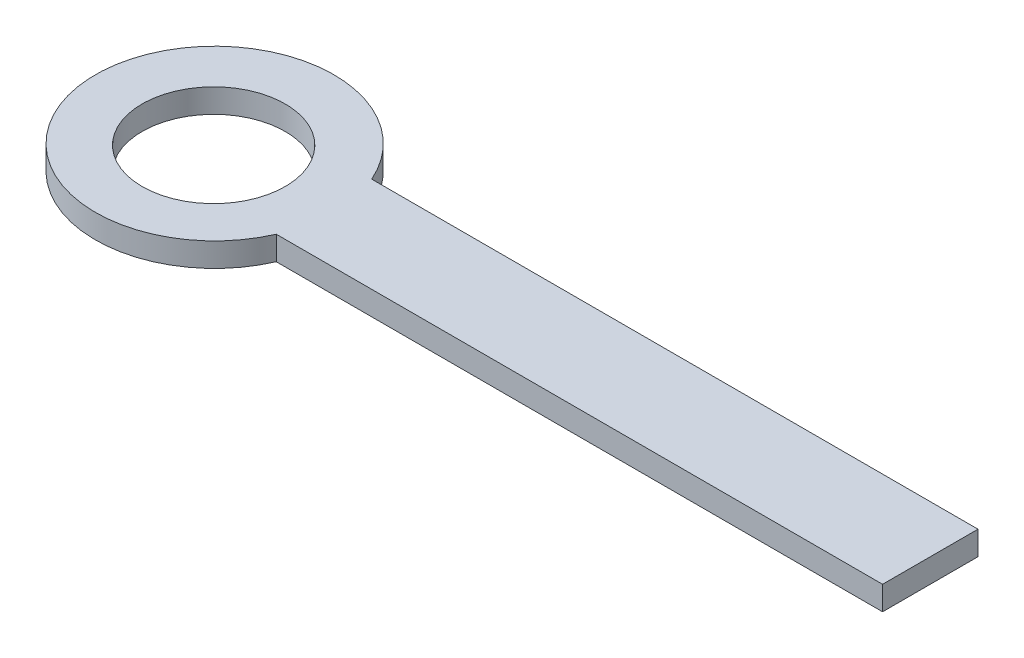
ISO-10303-21;
HEADER;
FILE_DESCRIPTION(('STEP AP214'),'2;1');
FILE_NAME('part.step','',(''),(''),'','','');
FILE_SCHEMA(('AUTOMOTIVE_DESIGN { 1 0 10303 214 1 1 1 1 }'));
ENDSEC;
DATA;
#1=APPLICATION_CONTEXT('core data for automotive mechanical design processes');
#2=APPLICATION_PROTOCOL_DEFINITION('international standard','automotive_design',2000,#1);
#3=PRODUCT_CONTEXT('',#1,'mechanical');
#4=PRODUCT('Part','Part','',(#3));
#5=PRODUCT_RELATED_PRODUCT_CATEGORY('part','',(#4));
#6=PRODUCT_DEFINITION_FORMATION('','',#4);
#7=PRODUCT_DEFINITION_CONTEXT('part definition',#1,'design');
#8=PRODUCT_DEFINITION('design','',#6,#7);
#9=PRODUCT_DEFINITION_SHAPE('','',#8);
#10=(LENGTH_UNIT() NAMED_UNIT(*) SI_UNIT(.MILLI.,.METRE.));
#11=(NAMED_UNIT(*) PLANE_ANGLE_UNIT() SI_UNIT($,.RADIAN.));
#12=(NAMED_UNIT(*) SI_UNIT($,.STERADIAN.) SOLID_ANGLE_UNIT());
#13=UNCERTAINTY_MEASURE_WITH_UNIT(LENGTH_MEASURE(1.E-05),#10,'distance_accuracy_value','');
#14=(GEOMETRIC_REPRESENTATION_CONTEXT(3) GLOBAL_UNCERTAINTY_ASSIGNED_CONTEXT((#13)) GLOBAL_UNIT_ASSIGNED_CONTEXT((#10,
#11,#12)) REPRESENTATION_CONTEXT('',''));
#15=CARTESIAN_POINT('',(0.,0.,0.));
#16=DIRECTION('',(0.,0.,1.));
#17=DIRECTION('',(1.,0.,0.));
#18=AXIS2_PLACEMENT_3D('',#15,#16,#17);
#19=CARTESIAN_POINT('',(-53.4496053692822,10.,-12.6811594202899));
#20=DIRECTION('',(0.,0.,-1.));
#21=DIRECTION('',(-1.,0.,0.));
#22=AXIS2_PLACEMENT_3D('',#19,#20,#21);
#23=PLANE('',#22);
#24=DIRECTION('',(1.,0.,0.));
#25=VECTOR('',#24,1.);
#26=CARTESIAN_POINT('',(-53.4496053692822,0.,-12.6811594202899));
#27=LINE('',#26,#25);
#28=CARTESIAN_POINT('',(-53.4496053692822,0.,-12.6811594202899));
#29=VERTEX_POINT('',#28);
#30=CARTESIAN_POINT('',(200.724637681159,0.,-12.6811594202899));
#31=VERTEX_POINT('',#30);
#32=EDGE_CURVE('E103',#29,#31,#27,.T.);
#33=ORIENTED_EDGE('',*,*,#32,.F.);
#34=DIRECTION('',(0.,-1.,0.));
#35=VECTOR('',#34,1.);
#36=CARTESIAN_POINT('',(-53.4496053692822,10.,-12.6811594202899));
#37=LINE('',#36,#35);
#38=CARTESIAN_POINT('',(-53.4496053692822,10.,-12.6811594202899));
#39=VERTEX_POINT('',#38);
#40=EDGE_CURVE('E11',#39,#29,#37,.T.);
#41=ORIENTED_EDGE('',*,*,#40,.F.);
#42=DIRECTION('',(1.,0.,0.));
#43=VECTOR('',#42,1.);
#44=CARTESIAN_POINT('',(-53.4496053692822,10.,-12.6811594202899));
#45=LINE('',#44,#43);
#46=CARTESIAN_POINT('',(200.724637681159,10.,-12.6811594202899));
#47=VERTEX_POINT('',#46);
#48=EDGE_CURVE('E97',#39,#47,#45,.T.);
#49=ORIENTED_EDGE('',*,*,#48,.T.);
#50=DIRECTION('',(0.,-1.,0.));
#51=VECTOR('',#50,1.);
#52=CARTESIAN_POINT('',(200.724637681159,10.,-12.6811594202899));
#53=LINE('',#52,#51);
#54=EDGE_CURVE('E40',#47,#31,#53,.T.);
#55=ORIENTED_EDGE('',*,*,#54,.T.);
#56=EDGE_LOOP('',(#33,#41,#49,#55));
#57=FACE_BOUND('',#56,.T.);
#58=ADVANCED_FACE('F37',(#57),#23,.T.);
#59=CARTESIAN_POINT('',(-99.2753623188406,10.,7.31884057971014));
#60=DIRECTION('',(0.,-1.,0.));
#61=DIRECTION('',(0.,0.,-1.));
#62=AXIS2_PLACEMENT_3D('',#59,#60,#61);
#63=CYLINDRICAL_SURFACE('',#62,50.);
#64=CARTESIAN_POINT('',(-99.2753623188406,0.,7.31884057971014));
#65=DIRECTION('',(0.,1.,0.));
#66=DIRECTION('',(0.,0.,1.));
#67=AXIS2_PLACEMENT_3D('',#64,#65,#66);
#68=CIRCLE('',#67,50.);
#69=CARTESIAN_POINT('',(-53.4496053692822,0.,27.3188405797101));
#70=VERTEX_POINT('',#69);
#71=EDGE_CURVE('E70',#29,#70,#68,.T.);
#72=ORIENTED_EDGE('',*,*,#71,.T.);
#73=DIRECTION('',(0.,-1.,0.));
#74=VECTOR('',#73,1.);
#75=CARTESIAN_POINT('',(-53.4496053692822,10.,27.3188405797101));
#76=LINE('',#75,#74);
#77=CARTESIAN_POINT('',(-53.4496053692822,10.,27.3188405797101));
#78=VERTEX_POINT('',#77);
#79=EDGE_CURVE('E46',#78,#70,#76,.T.);
#80=ORIENTED_EDGE('',*,*,#79,.F.);
#81=CARTESIAN_POINT('',(-99.2753623188406,10.,7.31884057971014));
#82=DIRECTION('',(0.,1.,0.));
#83=DIRECTION('',(0.,0.,1.));
#84=AXIS2_PLACEMENT_3D('',#81,#82,#83);
#85=CIRCLE('',#84,50.);
#86=EDGE_CURVE('E87',#39,#78,#85,.T.);
#87=ORIENTED_EDGE('',*,*,#86,.F.);
#88=ORIENTED_EDGE('',*,*,#40,.T.);
#89=EDGE_LOOP('',(#72,#80,#87,#88));
#90=FACE_BOUND('',#89,.T.);
#91=ADVANCED_FACE('F114',(#90),#63,.T.);
#92=CARTESIAN_POINT('',(-53.4496053692822,10.,27.3188405797101));
#93=DIRECTION('',(0.,0.,-1.));
#94=DIRECTION('',(-1.,0.,0.));
#95=AXIS2_PLACEMENT_3D('',#92,#93,#94);
#96=PLANE('',#95);
#97=DIRECTION('',(1.,0.,0.));
#98=VECTOR('',#97,1.);
#99=CARTESIAN_POINT('',(-53.4496053692822,0.,27.3188405797101));
#100=LINE('',#99,#98);
#101=CARTESIAN_POINT('',(200.724637681159,0.,27.3188405797101));
#102=VERTEX_POINT('',#101);
#103=EDGE_CURVE('E94',#70,#102,#100,.T.);
#104=ORIENTED_EDGE('',*,*,#103,.T.);
#105=DIRECTION('',(0.,-1.,0.));
#106=VECTOR('',#105,1.);
#107=CARTESIAN_POINT('',(200.724637681159,10.,27.3188405797101));
#108=LINE('',#107,#106);
#109=CARTESIAN_POINT('',(200.724637681159,10.,27.3188405797101));
#110=VERTEX_POINT('',#109);
#111=EDGE_CURVE('E91',#110,#102,#108,.T.);
#112=ORIENTED_EDGE('',*,*,#111,.F.);
#113=DIRECTION('',(1.,0.,0.));
#114=VECTOR('',#113,1.);
#115=CARTESIAN_POINT('',(-53.4496053692822,10.,27.3188405797101));
#116=LINE('',#115,#114);
#117=EDGE_CURVE('E82',#78,#110,#116,.T.);
#118=ORIENTED_EDGE('',*,*,#117,.F.);
#119=ORIENTED_EDGE('',*,*,#79,.T.);
#120=EDGE_LOOP('',(#104,#112,#118,#119));
#121=FACE_BOUND('',#120,.T.);
#122=ADVANCED_FACE('F92',(#121),#96,.F.);
#123=CARTESIAN_POINT('',(200.724637681159,10.,-12.6811594202899));
#124=DIRECTION('',(1.,0.,0.));
#125=DIRECTION('',(0.,0.,-1.));
#126=AXIS2_PLACEMENT_3D('',#123,#124,#125);
#127=PLANE('',#126);
#128=DIRECTION('',(0.,0.,1.));
#129=VECTOR('',#128,1.);
#130=CARTESIAN_POINT('',(200.724637681159,0.,-12.6811594202899));
#131=LINE('',#130,#129);
#132=EDGE_CURVE('E106',#31,#102,#131,.T.);
#133=ORIENTED_EDGE('',*,*,#132,.F.);
#134=ORIENTED_EDGE('',*,*,#54,.F.);
#135=DIRECTION('',(0.,0.,1.));
#136=VECTOR('',#135,1.);
#137=CARTESIAN_POINT('',(200.724637681159,10.,-12.6811594202899));
#138=LINE('',#137,#136);
#139=EDGE_CURVE('E86',#47,#110,#138,.T.);
#140=ORIENTED_EDGE('',*,*,#139,.T.);
#141=ORIENTED_EDGE('',*,*,#111,.T.);
#142=EDGE_LOOP('',(#133,#134,#140,#141));
#143=FACE_BOUND('',#142,.T.);
#144=ADVANCED_FACE('F96',(#143),#127,.T.);
#145=CARTESIAN_POINT('',(-99.2753623188406,10.,7.31884057971014));
#146=DIRECTION('',(0.,1.,0.));
#147=DIRECTION('',(0.,0.,1.));
#148=AXIS2_PLACEMENT_3D('',#145,#146,#147);
#149=PLANE('',#148);
#150=CARTESIAN_POINT('',(-98.8740584949783,10.,8.13183276553934));
#151=DIRECTION('',(0.,1.,0.));
#152=DIRECTION('',(0.,0.,1.));
#153=AXIS2_PLACEMENT_3D('',#150,#151,#152);
#154=CIRCLE('',#153,30.);
#155=CARTESIAN_POINT('',(-98.8740584949783,10.,38.1318327655393));
#156=VERTEX_POINT('',#155);
#157=EDGE_CURVE('E145',#156,#156,#154,.T.);
#158=ORIENTED_EDGE('',*,*,#157,.F.);
#159=EDGE_LOOP('',(#158));
#160=FACE_BOUND('',#159,.T.);
#161=ORIENTED_EDGE('',*,*,#48,.F.);
#162=ORIENTED_EDGE('',*,*,#86,.T.);
#163=ORIENTED_EDGE('',*,*,#117,.T.);
#164=ORIENTED_EDGE('',*,*,#139,.F.);
#165=EDGE_LOOP('',(#161,#162,#163,#164));
#166=FACE_BOUND('',#165,.T.);
#167=ADVANCED_FACE('F85',(#160,#166),#149,.T.);
#168=CARTESIAN_POINT('',(-99.2753623188406,0.,7.31884057971014));
#169=DIRECTION('',(0.,1.,0.));
#170=DIRECTION('',(0.,0.,1.));
#171=AXIS2_PLACEMENT_3D('',#168,#169,#170);
#172=PLANE('',#171);
#173=CARTESIAN_POINT('',(-98.8740584949783,0.,8.13183276553934));
#174=DIRECTION('',(0.,1.,0.));
#175=DIRECTION('',(0.,0.,1.));
#176=AXIS2_PLACEMENT_3D('',#173,#174,#175);
#177=CIRCLE('',#176,30.);
#178=CARTESIAN_POINT('',(-98.8740584949783,0.,38.1318327655393));
#179=VERTEX_POINT('',#178);
#180=EDGE_CURVE('E107',#179,#179,#177,.T.);
#181=ORIENTED_EDGE('',*,*,#180,.T.);
#182=EDGE_LOOP('',(#181));
#183=FACE_BOUND('',#182,.T.);
#184=ORIENTED_EDGE('',*,*,#32,.T.);
#185=ORIENTED_EDGE('',*,*,#132,.T.);
#186=ORIENTED_EDGE('',*,*,#103,.F.);
#187=ORIENTED_EDGE('',*,*,#71,.F.);
#188=EDGE_LOOP('',(#184,#185,#186,#187));
#189=FACE_BOUND('',#188,.T.);
#190=ADVANCED_FACE('F112',(#183,#189),#172,.F.);
#191=CARTESIAN_POINT('',(-98.8740584949783,0.,8.13183276553934));
#192=DIRECTION('',(0.,1.,0.));
#193=DIRECTION('',(0.,0.,1.));
#194=AXIS2_PLACEMENT_3D('',#191,#192,#193);
#195=CYLINDRICAL_SURFACE('',#194,30.);
#196=ORIENTED_EDGE('',*,*,#180,.F.);
#197=EDGE_LOOP('',(#196));
#198=FACE_BOUND('',#197,.T.);
#199=ORIENTED_EDGE('',*,*,#157,.T.);
#200=EDGE_LOOP('',(#199));
#201=FACE_BOUND('',#200,.T.);
#202=ADVANCED_FACE('F133',(#198,#201),#195,.F.);
#203=CLOSED_SHELL('',(#58,#91,#122,#144,#167,#190,#202));
#204=MANIFOLD_SOLID_BREP('B2',#203);
#205=ADVANCED_BREP_SHAPE_REPRESENTATION('',(#18,#204),#14);
#206=SHAPE_DEFINITION_REPRESENTATION(#9,#205);
ENDSEC;
END-ISO-10303-21;
